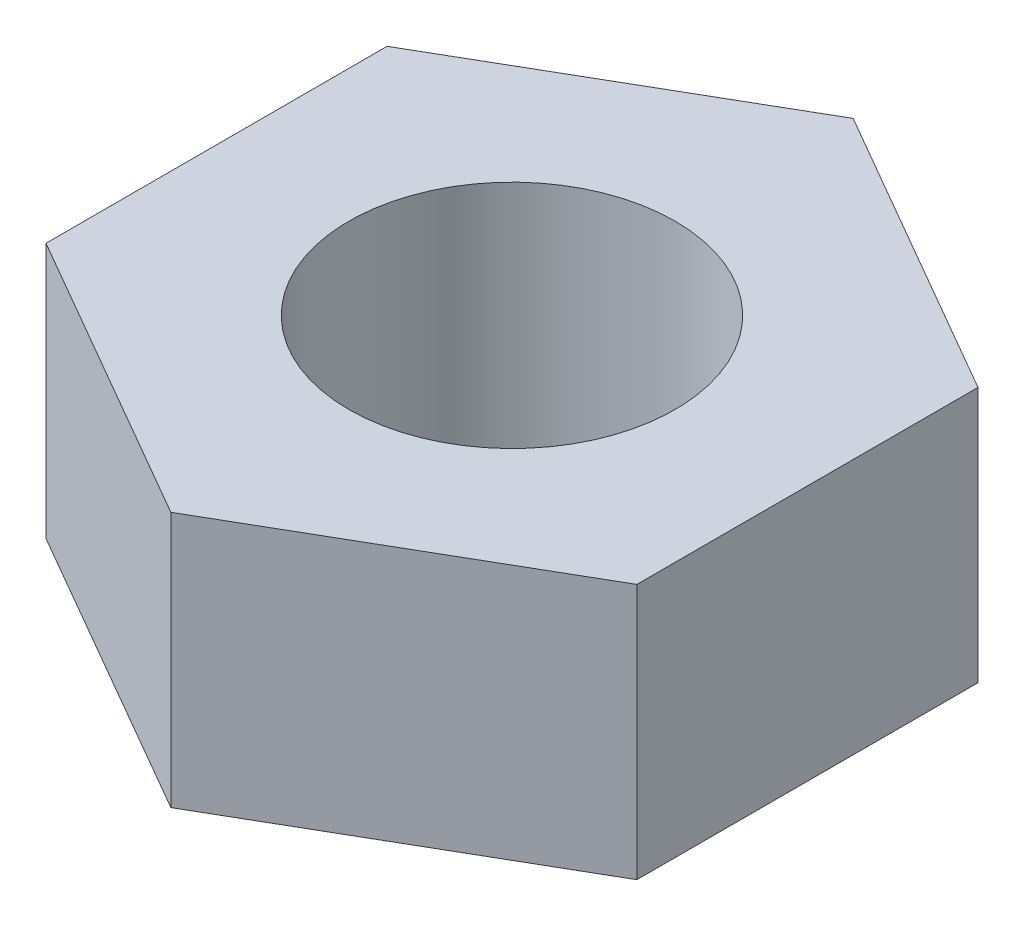
ISO-10303-21;
HEADER;
FILE_DESCRIPTION(('STEP AP214'),'2;1');
FILE_NAME('part.step','',(''),(''),'','','');
FILE_SCHEMA(('AUTOMOTIVE_DESIGN { 1 0 10303 214 1 1 1 1 }'));
ENDSEC;
DATA;
#1=APPLICATION_CONTEXT('core data for automotive mechanical design processes');
#2=APPLICATION_PROTOCOL_DEFINITION('international standard','automotive_design',2000,#1);
#3=PRODUCT_CONTEXT('',#1,'mechanical');
#4=PRODUCT('Part','Part','',(#3));
#5=PRODUCT_RELATED_PRODUCT_CATEGORY('part','',(#4));
#6=PRODUCT_DEFINITION_FORMATION('','',#4);
#7=PRODUCT_DEFINITION_CONTEXT('part definition',#1,'design');
#8=PRODUCT_DEFINITION('design','',#6,#7);
#9=PRODUCT_DEFINITION_SHAPE('','',#8);
#10=(LENGTH_UNIT() NAMED_UNIT(*) SI_UNIT(.MILLI.,.METRE.));
#11=(NAMED_UNIT(*) PLANE_ANGLE_UNIT() SI_UNIT($,.RADIAN.));
#12=(NAMED_UNIT(*) SI_UNIT($,.STERADIAN.) SOLID_ANGLE_UNIT());
#13=UNCERTAINTY_MEASURE_WITH_UNIT(LENGTH_MEASURE(1.E-05),#10,'distance_accuracy_value','');
#14=(GEOMETRIC_REPRESENTATION_CONTEXT(3) GLOBAL_UNCERTAINTY_ASSIGNED_CONTEXT((#13)) GLOBAL_UNIT_ASSIGNED_CONTEXT((#10,
#11,#12)) REPRESENTATION_CONTEXT('',''));
#15=CARTESIAN_POINT('',(0.,0.,0.));
#16=DIRECTION('',(0.,0.,1.));
#17=DIRECTION('',(1.,0.,0.));
#18=AXIS2_PLACEMENT_3D('',#15,#16,#17);
#19=CARTESIAN_POINT('',(3.35,2.9,-1.93412340178525));
#20=DIRECTION('',(-0.5,0.,0.866025403784439));
#21=DIRECTION('',(0.866025403784439,0.,0.5));
#22=AXIS2_PLACEMENT_3D('',#19,#20,#21);
#23=PLANE('',#22);
#24=DIRECTION('',(-0.866025403784439,0.,-0.5));
#25=VECTOR('',#24,1.);
#26=CARTESIAN_POINT('',(3.35,0.,-1.93412340178525));
#27=LINE('',#26,#25);
#28=CARTESIAN_POINT('',(3.35,0.,-1.93412340178525));
#29=VERTEX_POINT('',#28);
#30=CARTESIAN_POINT('',(0.,0.,-3.86824680357049));
#31=VERTEX_POINT('',#30);
#32=EDGE_CURVE('E119',#29,#31,#27,.T.);
#33=ORIENTED_EDGE('',*,*,#32,.T.);
#34=DIRECTION('',(0.,-1.,0.));
#35=VECTOR('',#34,1.);
#36=CARTESIAN_POINT('',(0.,2.9,-3.86824680357049));
#37=LINE('',#36,#35);
#38=CARTESIAN_POINT('',(0.,2.9,-3.86824680357049));
#39=VERTEX_POINT('',#38);
#40=EDGE_CURVE('E11',#39,#31,#37,.T.);
#41=ORIENTED_EDGE('',*,*,#40,.F.);
#42=DIRECTION('',(-0.866025403784439,0.,-0.5));
#43=VECTOR('',#42,1.);
#44=CARTESIAN_POINT('',(3.35,2.9,-1.93412340178525));
#45=LINE('',#44,#43);
#46=CARTESIAN_POINT('',(3.35,2.9,-1.93412340178525));
#47=VERTEX_POINT('',#46);
#48=EDGE_CURVE('E130',#47,#39,#45,.T.);
#49=ORIENTED_EDGE('',*,*,#48,.F.);
#50=DIRECTION('',(0.,-1.,0.));
#51=VECTOR('',#50,1.);
#52=CARTESIAN_POINT('',(3.35,2.9,-1.93412340178525));
#53=LINE('',#52,#51);
#54=EDGE_CURVE('E115',#47,#29,#53,.T.);
#55=ORIENTED_EDGE('',*,*,#54,.T.);
#56=EDGE_LOOP('',(#33,#41,#49,#55));
#57=FACE_BOUND('',#56,.T.);
#58=ADVANCED_FACE('F35',(#57),#23,.F.);
#59=CARTESIAN_POINT('',(0.,2.9,-3.86824680357049));
#60=DIRECTION('',(0.5,0.,0.866025403784439));
#61=DIRECTION('',(0.866025403784439,0.,-0.5));
#62=AXIS2_PLACEMENT_3D('',#59,#60,#61);
#63=PLANE('',#62);
#64=DIRECTION('',(-0.866025403784439,0.,0.5));
#65=VECTOR('',#64,1.);
#66=CARTESIAN_POINT('',(0.,0.,-3.86824680357049));
#67=LINE('',#66,#65);
#68=CARTESIAN_POINT('',(-3.35,0.,-1.93412340178525));
#69=VERTEX_POINT('',#68);
#70=EDGE_CURVE('E122',#31,#69,#67,.T.);
#71=ORIENTED_EDGE('',*,*,#70,.T.);
#72=DIRECTION('',(0.,-1.,0.));
#73=VECTOR('',#72,1.);
#74=CARTESIAN_POINT('',(-3.35,2.9,-1.93412340178525));
#75=LINE('',#74,#73);
#76=CARTESIAN_POINT('',(-3.35,2.9,-1.93412340178525));
#77=VERTEX_POINT('',#76);
#78=EDGE_CURVE('E43',#77,#69,#75,.T.);
#79=ORIENTED_EDGE('',*,*,#78,.F.);
#80=DIRECTION('',(-0.866025403784439,0.,0.5));
#81=VECTOR('',#80,1.);
#82=CARTESIAN_POINT('',(0.,2.9,-3.86824680357049));
#83=LINE('',#82,#81);
#84=EDGE_CURVE('E88',#39,#77,#83,.T.);
#85=ORIENTED_EDGE('',*,*,#84,.F.);
#86=ORIENTED_EDGE('',*,*,#40,.T.);
#87=EDGE_LOOP('',(#71,#79,#85,#86));
#88=FACE_BOUND('',#87,.T.);
#89=ADVANCED_FACE('F155',(#88),#63,.F.);
#90=CARTESIAN_POINT('',(-3.35,2.9,-1.93412340178525));
#91=DIRECTION('',(1.,0.,0.));
#92=DIRECTION('',(0.,0.,-1.));
#93=AXIS2_PLACEMENT_3D('',#90,#91,#92);
#94=PLANE('',#93);
#95=DIRECTION('',(0.,0.,1.));
#96=VECTOR('',#95,1.);
#97=CARTESIAN_POINT('',(-3.35,0.,-1.93412340178525));
#98=LINE('',#97,#96);
#99=CARTESIAN_POINT('',(-3.35,0.,1.93412340178525));
#100=VERTEX_POINT('',#99);
#101=EDGE_CURVE('E125',#69,#100,#98,.T.);
#102=ORIENTED_EDGE('',*,*,#101,.T.);
#103=DIRECTION('',(0.,-1.,0.));
#104=VECTOR('',#103,1.);
#105=CARTESIAN_POINT('',(-3.35,2.9,1.93412340178525));
#106=LINE('',#105,#104);
#107=CARTESIAN_POINT('',(-3.35,2.9,1.93412340178525));
#108=VERTEX_POINT('',#107);
#109=EDGE_CURVE('E110',#108,#100,#106,.T.);
#110=ORIENTED_EDGE('',*,*,#109,.F.);
#111=DIRECTION('',(0.,0.,1.));
#112=VECTOR('',#111,1.);
#113=CARTESIAN_POINT('',(-3.35,2.9,-1.93412340178525));
#114=LINE('',#113,#112);
#115=EDGE_CURVE('E101',#77,#108,#114,.T.);
#116=ORIENTED_EDGE('',*,*,#115,.F.);
#117=ORIENTED_EDGE('',*,*,#78,.T.);
#118=EDGE_LOOP('',(#102,#110,#116,#117));
#119=FACE_BOUND('',#118,.T.);
#120=ADVANCED_FACE('F136',(#119),#94,.F.);
#121=CARTESIAN_POINT('',(-3.35,2.9,1.93412340178525));
#122=DIRECTION('',(0.5,0.,-0.866025403784439));
#123=DIRECTION('',(-0.866025403784439,0.,-0.5));
#124=AXIS2_PLACEMENT_3D('',#121,#122,#123);
#125=PLANE('',#124);
#126=DIRECTION('',(0.866025403784439,0.,0.5));
#127=VECTOR('',#126,1.);
#128=CARTESIAN_POINT('',(-3.35,0.,1.93412340178525));
#129=LINE('',#128,#127);
#130=CARTESIAN_POINT('',(0.,0.,3.86824680357049));
#131=VERTEX_POINT('',#130);
#132=EDGE_CURVE('E109',#100,#131,#129,.T.);
#133=ORIENTED_EDGE('',*,*,#132,.T.);
#134=DIRECTION('',(0.,-1.,0.));
#135=VECTOR('',#134,1.);
#136=CARTESIAN_POINT('',(0.,2.9,3.86824680357049));
#137=LINE('',#136,#135);
#138=CARTESIAN_POINT('',(0.,2.9,3.86824680357049));
#139=VERTEX_POINT('',#138);
#140=EDGE_CURVE('E106',#139,#131,#137,.T.);
#141=ORIENTED_EDGE('',*,*,#140,.F.);
#142=DIRECTION('',(0.866025403784439,0.,0.5));
#143=VECTOR('',#142,1.);
#144=CARTESIAN_POINT('',(-3.35,2.9,1.93412340178525));
#145=LINE('',#144,#143);
#146=EDGE_CURVE('E95',#108,#139,#145,.T.);
#147=ORIENTED_EDGE('',*,*,#146,.F.);
#148=ORIENTED_EDGE('',*,*,#109,.T.);
#149=EDGE_LOOP('',(#133,#141,#147,#148));
#150=FACE_BOUND('',#149,.T.);
#151=ADVANCED_FACE('F107',(#150),#125,.F.);
#152=CARTESIAN_POINT('',(0.,2.9,3.86824680357049));
#153=DIRECTION('',(-0.5,0.,-0.866025403784439));
#154=DIRECTION('',(-0.866025403784439,0.,0.5));
#155=AXIS2_PLACEMENT_3D('',#152,#153,#154);
#156=PLANE('',#155);
#157=DIRECTION('',(0.866025403784439,0.,-0.5));
#158=VECTOR('',#157,1.);
#159=CARTESIAN_POINT('',(0.,0.,3.86824680357049));
#160=LINE('',#159,#158);
#161=CARTESIAN_POINT('',(3.35,0.,1.93412340178525));
#162=VERTEX_POINT('',#161);
#163=EDGE_CURVE('E74',#131,#162,#160,.T.);
#164=ORIENTED_EDGE('',*,*,#163,.T.);
#165=DIRECTION('',(0.,-1.,0.));
#166=VECTOR('',#165,1.);
#167=CARTESIAN_POINT('',(3.35,2.9,1.93412340178525));
#168=LINE('',#167,#166);
#169=CARTESIAN_POINT('',(3.35,2.9,1.93412340178525));
#170=VERTEX_POINT('',#169);
#171=EDGE_CURVE('E111',#170,#162,#168,.T.);
#172=ORIENTED_EDGE('',*,*,#171,.F.);
#173=DIRECTION('',(0.866025403784439,0.,-0.5));
#174=VECTOR('',#173,1.);
#175=CARTESIAN_POINT('',(0.,2.9,3.86824680357049));
#176=LINE('',#175,#174);
#177=EDGE_CURVE('E99',#139,#170,#176,.T.);
#178=ORIENTED_EDGE('',*,*,#177,.F.);
#179=ORIENTED_EDGE('',*,*,#140,.T.);
#180=EDGE_LOOP('',(#164,#172,#178,#179));
#181=FACE_BOUND('',#180,.T.);
#182=ADVANCED_FACE('F113',(#181),#156,.F.);
#183=CARTESIAN_POINT('',(3.35,2.9,1.93412340178525));
#184=DIRECTION('',(-1.,0.,0.));
#185=DIRECTION('',(0.,0.,1.));
#186=AXIS2_PLACEMENT_3D('',#183,#184,#185);
#187=PLANE('',#186);
#188=DIRECTION('',(0.,0.,-1.));
#189=VECTOR('',#188,1.);
#190=CARTESIAN_POINT('',(3.35,0.,1.93412340178525));
#191=LINE('',#190,#189);
#192=EDGE_CURVE('E80',#162,#29,#191,.T.);
#193=ORIENTED_EDGE('',*,*,#192,.T.);
#194=ORIENTED_EDGE('',*,*,#54,.F.);
#195=DIRECTION('',(0.,0.,-1.));
#196=VECTOR('',#195,1.);
#197=CARTESIAN_POINT('',(3.35,2.9,1.93412340178525));
#198=LINE('',#197,#196);
#199=EDGE_CURVE('E51',#170,#47,#198,.T.);
#200=ORIENTED_EDGE('',*,*,#199,.F.);
#201=ORIENTED_EDGE('',*,*,#171,.T.);
#202=EDGE_LOOP('',(#193,#194,#200,#201));
#203=FACE_BOUND('',#202,.T.);
#204=ADVANCED_FACE('F143',(#203),#187,.F.);
#205=CARTESIAN_POINT('',(0.,2.9,0.));
#206=DIRECTION('',(0.,1.,0.));
#207=DIRECTION('',(0.,0.,1.));
#208=AXIS2_PLACEMENT_3D('',#205,#206,#207);
#209=PLANE('',#208);
#210=CARTESIAN_POINT('',(0.,2.9,0.));
#211=DIRECTION('',(0.,1.,0.));
#212=DIRECTION('',(0.,0.,1.));
#213=AXIS2_PLACEMENT_3D('',#210,#211,#212);
#214=CIRCLE('',#213,1.85);
#215=CARTESIAN_POINT('',(0.,2.9,1.85));
#216=VERTEX_POINT('',#215);
#217=EDGE_CURVE('E208',#216,#216,#214,.T.);
#218=ORIENTED_EDGE('',*,*,#217,.F.);
#219=EDGE_LOOP('',(#218));
#220=FACE_BOUND('',#219,.T.);
#221=ORIENTED_EDGE('',*,*,#48,.T.);
#222=ORIENTED_EDGE('',*,*,#84,.T.);
#223=ORIENTED_EDGE('',*,*,#115,.T.);
#224=ORIENTED_EDGE('',*,*,#146,.T.);
#225=ORIENTED_EDGE('',*,*,#177,.T.);
#226=ORIENTED_EDGE('',*,*,#199,.T.);
#227=EDGE_LOOP('',(#221,#222,#223,#224,#225,#226));
#228=FACE_BOUND('',#227,.T.);
#229=ADVANCED_FACE('F97',(#220,#228),#209,.T.);
#230=CARTESIAN_POINT('',(0.,0.,0.));
#231=DIRECTION('',(0.,1.,0.));
#232=DIRECTION('',(0.,0.,1.));
#233=AXIS2_PLACEMENT_3D('',#230,#231,#232);
#234=PLANE('',#233);
#235=CARTESIAN_POINT('',(0.,0.,0.));
#236=DIRECTION('',(0.,1.,0.));
#237=DIRECTION('',(0.,0.,1.));
#238=AXIS2_PLACEMENT_3D('',#235,#236,#237);
#239=CIRCLE('',#238,1.85);
#240=CARTESIAN_POINT('',(0.,0.,1.85));
#241=VERTEX_POINT('',#240);
#242=EDGE_CURVE('E123',#241,#241,#239,.F.);
#243=ORIENTED_EDGE('',*,*,#242,.F.);
#244=EDGE_LOOP('',(#243));
#245=FACE_BOUND('',#244,.T.);
#246=ORIENTED_EDGE('',*,*,#32,.F.);
#247=ORIENTED_EDGE('',*,*,#192,.F.);
#248=ORIENTED_EDGE('',*,*,#163,.F.);
#249=ORIENTED_EDGE('',*,*,#132,.F.);
#250=ORIENTED_EDGE('',*,*,#101,.F.);
#251=ORIENTED_EDGE('',*,*,#70,.F.);
#252=EDGE_LOOP('',(#246,#247,#248,#249,#250,#251));
#253=FACE_BOUND('',#252,.T.);
#254=ADVANCED_FACE('F139',(#245,#253),#234,.F.);
#255=CARTESIAN_POINT('',(0.,-0.00100000000000013,0.));
#256=DIRECTION('',(0.,1.,0.));
#257=DIRECTION('',(0.,0.,1.));
#258=AXIS2_PLACEMENT_3D('',#255,#256,#257);
#259=CYLINDRICAL_SURFACE('',#258,1.85);
#260=ORIENTED_EDGE('',*,*,#217,.T.);
#261=EDGE_LOOP('',(#260));
#262=FACE_BOUND('',#261,.T.);
#263=ORIENTED_EDGE('',*,*,#242,.T.);
#264=EDGE_LOOP('',(#263));
#265=FACE_BOUND('',#264,.T.);
#266=ADVANCED_FACE('F192',(#262,#265),#259,.F.);
#267=CLOSED_SHELL('',(#58,#89,#120,#151,#182,#204,#229,#254,#266));
#268=MANIFOLD_SOLID_BREP('B2',#267);
#269=ADVANCED_BREP_SHAPE_REPRESENTATION('',(#18,#268),#14);
#270=SHAPE_DEFINITION_REPRESENTATION(#9,#269);
ENDSEC;
END-ISO-10303-21;
